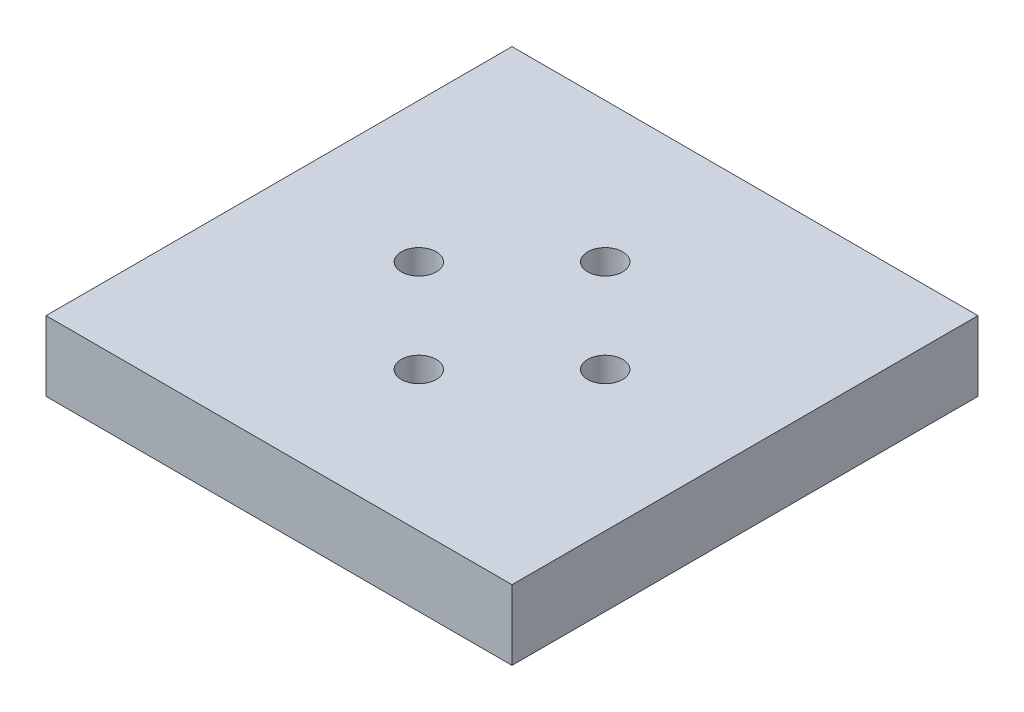
ISO-10303-21;
HEADER;
FILE_DESCRIPTION(('STEP AP214'),'2;1');
FILE_NAME('part.step','',(''),(''),'','','');
FILE_SCHEMA(('AUTOMOTIVE_DESIGN { 1 0 10303 214 1 1 1 1 }'));
ENDSEC;
DATA;
#1=APPLICATION_CONTEXT('core data for automotive mechanical design processes');
#2=APPLICATION_PROTOCOL_DEFINITION('international standard','automotive_design',2000,#1);
#3=PRODUCT_CONTEXT('',#1,'mechanical');
#4=PRODUCT('Part','Part','',(#3));
#5=PRODUCT_RELATED_PRODUCT_CATEGORY('part','',(#4));
#6=PRODUCT_DEFINITION_FORMATION('','',#4);
#7=PRODUCT_DEFINITION_CONTEXT('part definition',#1,'design');
#8=PRODUCT_DEFINITION('design','',#6,#7);
#9=PRODUCT_DEFINITION_SHAPE('','',#8);
#10=(LENGTH_UNIT() NAMED_UNIT(*) SI_UNIT(.MILLI.,.METRE.));
#11=(NAMED_UNIT(*) PLANE_ANGLE_UNIT() SI_UNIT($,.RADIAN.));
#12=(NAMED_UNIT(*) SI_UNIT($,.STERADIAN.) SOLID_ANGLE_UNIT());
#13=UNCERTAINTY_MEASURE_WITH_UNIT(LENGTH_MEASURE(1.E-05),#10,'distance_accuracy_value','');
#14=(GEOMETRIC_REPRESENTATION_CONTEXT(3) GLOBAL_UNCERTAINTY_ASSIGNED_CONTEXT((#13)) GLOBAL_UNIT_ASSIGNED_CONTEXT((#10,
#11,#12)) REPRESENTATION_CONTEXT('',''));
#15=CARTESIAN_POINT('',(0.,0.,0.));
#16=DIRECTION('',(0.,0.,1.));
#17=DIRECTION('',(1.,0.,0.));
#18=AXIS2_PLACEMENT_3D('',#15,#16,#17);
#19=CARTESIAN_POINT('',(0.,3.,0.));
#20=DIRECTION('',(0.,-1.,0.));
#21=DIRECTION('',(0.,0.,-1.));
#22=AXIS2_PLACEMENT_3D('',#19,#20,#21);
#23=PLANE('',#22);
#24=DIRECTION('',(0.,0.,-1.));
#25=VECTOR('',#24,1.);
#26=CARTESIAN_POINT('',(20.,3.,20.));
#27=LINE('',#26,#25);
#28=CARTESIAN_POINT('',(20.,3.,20.));
#29=VERTEX_POINT('',#28);
#30=CARTESIAN_POINT('',(20.,3.,-20.));
#31=VERTEX_POINT('',#30);
#32=EDGE_CURVE('E196',#29,#31,#27,.T.);
#33=ORIENTED_EDGE('',*,*,#32,.T.);
#34=DIRECTION('',(-1.,0.,0.));
#35=VECTOR('',#34,1.);
#36=CARTESIAN_POINT('',(-20.,3.,-20.));
#37=LINE('',#36,#35);
#38=CARTESIAN_POINT('',(-20.,3.,-20.));
#39=VERTEX_POINT('',#38);
#40=EDGE_CURVE('E203',#31,#39,#37,.T.);
#41=ORIENTED_EDGE('',*,*,#40,.T.);
#42=DIRECTION('',(0.,0.,1.));
#43=VECTOR('',#42,1.);
#44=CARTESIAN_POINT('',(-20.,3.,20.));
#45=LINE('',#44,#43);
#46=CARTESIAN_POINT('',(-20.,3.,20.));
#47=VERTEX_POINT('',#46);
#48=EDGE_CURVE('E206',#39,#47,#45,.T.);
#49=ORIENTED_EDGE('',*,*,#48,.T.);
#50=DIRECTION('',(1.,0.,0.));
#51=VECTOR('',#50,1.);
#52=CARTESIAN_POINT('',(-20.,3.,20.));
#53=LINE('',#52,#51);
#54=EDGE_CURVE('E209',#47,#29,#53,.T.);
#55=ORIENTED_EDGE('',*,*,#54,.T.);
#56=EDGE_LOOP('',(#33,#41,#49,#55));
#57=FACE_BOUND('',#56,.T.);
#58=CARTESIAN_POINT('',(0.,3.,-8.));
#59=DIRECTION('',(0.,1.,0.));
#60=DIRECTION('',(0.,0.,1.));
#61=AXIS2_PLACEMENT_3D('',#58,#59,#60);
#62=CIRCLE('',#61,1.5);
#63=CARTESIAN_POINT('',(0.,3.,-6.5));
#64=VERTEX_POINT('',#63);
#65=EDGE_CURVE('E192',#64,#64,#62,.T.);
#66=ORIENTED_EDGE('',*,*,#65,.F.);
#67=EDGE_LOOP('',(#66));
#68=FACE_BOUND('',#67,.T.);
#69=CARTESIAN_POINT('',(8.00000000000023,3.,-2.25904099284255E-13));
#70=DIRECTION('',(0.,1.,0.));
#71=DIRECTION('',(0.,0.,1.));
#72=AXIS2_PLACEMENT_3D('',#69,#70,#71);
#73=CIRCLE('',#72,1.50000000000018);
#74=CARTESIAN_POINT('',(8.00000000000023,3.,1.49999999999995));
#75=VERTEX_POINT('',#74);
#76=EDGE_CURVE('E184',#75,#75,#73,.T.);
#77=ORIENTED_EDGE('',*,*,#76,.F.);
#78=EDGE_LOOP('',(#77));
#79=FACE_BOUND('',#78,.T.);
#80=CARTESIAN_POINT('',(4.51808198568511E-13,3.,8.));
#81=DIRECTION('',(0.,1.,0.));
#82=DIRECTION('',(0.,0.,1.));
#83=AXIS2_PLACEMENT_3D('',#80,#81,#82);
#84=CIRCLE('',#83,1.50000000000049);
#85=CARTESIAN_POINT('',(4.51808198568511E-13,3.,9.50000000000048));
#86=VERTEX_POINT('',#85);
#87=EDGE_CURVE('E176',#86,#86,#84,.T.);
#88=ORIENTED_EDGE('',*,*,#87,.F.);
#89=EDGE_LOOP('',(#88));
#90=FACE_BOUND('',#89,.T.);
#91=CARTESIAN_POINT('',(-7.99999999999977,3.,2.26883816723573E-13));
#92=DIRECTION('',(0.,1.,0.));
#93=DIRECTION('',(0.,0.,1.));
#94=AXIS2_PLACEMENT_3D('',#91,#92,#93);
#95=CIRCLE('',#94,1.50000000000036);
#96=CARTESIAN_POINT('',(-7.99999999999977,3.,1.50000000000059));
#97=VERTEX_POINT('',#96);
#98=EDGE_CURVE('E168',#97,#97,#95,.T.);
#99=ORIENTED_EDGE('',*,*,#98,.F.);
#100=EDGE_LOOP('',(#99));
#101=FACE_BOUND('',#100,.T.);
#102=ADVANCED_FACE('F39',(#57,#68,#79,#90,#101),#23,.F.);
#103=CARTESIAN_POINT('',(0.,0.,0.));
#104=DIRECTION('',(0.,-1.,0.));
#105=DIRECTION('',(0.,0.,-1.));
#106=AXIS2_PLACEMENT_3D('',#103,#104,#105);
#107=PLANE('',#106);
#108=DIRECTION('',(-1.,0.,0.));
#109=VECTOR('',#108,1.);
#110=CARTESIAN_POINT('',(-16.,0.,16.));
#111=LINE('',#110,#109);
#112=CARTESIAN_POINT('',(16.,0.,16.));
#113=VERTEX_POINT('',#112);
#114=CARTESIAN_POINT('',(-16.,0.,16.));
#115=VERTEX_POINT('',#114);
#116=EDGE_CURVE('E55',#113,#115,#111,.T.);
#117=ORIENTED_EDGE('',*,*,#116,.T.);
#118=DIRECTION('',(0.,0.,-1.));
#119=VECTOR('',#118,1.);
#120=CARTESIAN_POINT('',(-16.,0.,16.));
#121=LINE('',#120,#119);
#122=CARTESIAN_POINT('',(-16.,0.,-16.));
#123=VERTEX_POINT('',#122);
#124=EDGE_CURVE('E59',#115,#123,#121,.T.);
#125=ORIENTED_EDGE('',*,*,#124,.T.);
#126=DIRECTION('',(1.,0.,0.));
#127=VECTOR('',#126,1.);
#128=CARTESIAN_POINT('',(-16.,0.,-16.));
#129=LINE('',#128,#127);
#130=CARTESIAN_POINT('',(16.,0.,-16.));
#131=VERTEX_POINT('',#130);
#132=EDGE_CURVE('E139',#123,#131,#129,.T.);
#133=ORIENTED_EDGE('',*,*,#132,.T.);
#134=DIRECTION('',(0.,0.,1.));
#135=VECTOR('',#134,1.);
#136=CARTESIAN_POINT('',(16.,0.,16.));
#137=LINE('',#136,#135);
#138=EDGE_CURVE('E114',#131,#113,#137,.T.);
#139=ORIENTED_EDGE('',*,*,#138,.T.);
#140=EDGE_LOOP('',(#117,#125,#133,#139));
#141=FACE_BOUND('',#140,.T.);
#142=CARTESIAN_POINT('',(4.51808198568511E-13,0.,8.));
#143=DIRECTION('',(0.,1.,0.));
#144=DIRECTION('',(0.,0.,1.));
#145=AXIS2_PLACEMENT_3D('',#142,#143,#144);
#146=CIRCLE('',#145,1.50000000000049);
#147=CARTESIAN_POINT('',(4.51808198568511E-13,0.,9.50000000000048));
#148=VERTEX_POINT('',#147);
#149=EDGE_CURVE('E172',#148,#148,#146,.T.);
#150=ORIENTED_EDGE('',*,*,#149,.T.);
#151=EDGE_LOOP('',(#150));
#152=FACE_BOUND('',#151,.T.);
#153=CARTESIAN_POINT('',(0.,0.,-8.));
#154=DIRECTION('',(0.,1.,0.));
#155=DIRECTION('',(0.,0.,1.));
#156=AXIS2_PLACEMENT_3D('',#153,#154,#155);
#157=CIRCLE('',#156,1.5);
#158=CARTESIAN_POINT('',(0.,0.,-6.5));
#159=VERTEX_POINT('',#158);
#160=EDGE_CURVE('E188',#159,#159,#157,.T.);
#161=ORIENTED_EDGE('',*,*,#160,.T.);
#162=EDGE_LOOP('',(#161));
#163=FACE_BOUND('',#162,.T.);
#164=CARTESIAN_POINT('',(8.00000000000023,0.,-2.25904099284255E-13));
#165=DIRECTION('',(0.,1.,0.));
#166=DIRECTION('',(0.,0.,1.));
#167=AXIS2_PLACEMENT_3D('',#164,#165,#166);
#168=CIRCLE('',#167,1.50000000000018);
#169=CARTESIAN_POINT('',(8.00000000000023,0.,1.49999999999995));
#170=VERTEX_POINT('',#169);
#171=EDGE_CURVE('E180',#170,#170,#168,.T.);
#172=ORIENTED_EDGE('',*,*,#171,.T.);
#173=EDGE_LOOP('',(#172));
#174=FACE_BOUND('',#173,.T.);
#175=CARTESIAN_POINT('',(-7.99999999999977,0.,2.26883816723573E-13));
#176=DIRECTION('',(0.,1.,0.));
#177=DIRECTION('',(0.,0.,1.));
#178=AXIS2_PLACEMENT_3D('',#175,#176,#177);
#179=CIRCLE('',#178,1.50000000000036);
#180=CARTESIAN_POINT('',(-7.99999999999977,0.,1.50000000000059));
#181=VERTEX_POINT('',#180);
#182=EDGE_CURVE('E167',#181,#181,#179,.T.);
#183=ORIENTED_EDGE('',*,*,#182,.T.);
#184=EDGE_LOOP('',(#183));
#185=FACE_BOUND('',#184,.T.);
#186=ADVANCED_FACE('F240',(#141,#152,#163,#174,#185),#107,.T.);
#187=CARTESIAN_POINT('',(20.,3.,20.));
#188=DIRECTION('',(-1.,0.,0.));
#189=DIRECTION('',(0.,0.,1.));
#190=AXIS2_PLACEMENT_3D('',#187,#188,#189);
#191=PLANE('',#190);
#192=DIRECTION('',(0.,-1.,0.));
#193=VECTOR('',#192,1.);
#194=CARTESIAN_POINT('',(20.,3.,20.));
#195=LINE('',#194,#193);
#196=CARTESIAN_POINT('',(20.,-3.,20.));
#197=VERTEX_POINT('',#196);
#198=EDGE_CURVE('E212',#29,#197,#195,.T.);
#199=ORIENTED_EDGE('',*,*,#198,.T.);
#200=DIRECTION('',(0.,0.,1.));
#201=VECTOR('',#200,1.);
#202=CARTESIAN_POINT('',(20.,-3.,20.));
#203=LINE('',#202,#201);
#204=CARTESIAN_POINT('',(20.,-3.,-20.));
#205=VERTEX_POINT('',#204);
#206=EDGE_CURVE('E159',#205,#197,#203,.T.);
#207=ORIENTED_EDGE('',*,*,#206,.F.);
#208=DIRECTION('',(0.,-1.,0.));
#209=VECTOR('',#208,1.);
#210=CARTESIAN_POINT('',(20.,3.,-20.));
#211=LINE('',#210,#209);
#212=EDGE_CURVE('E11',#31,#205,#211,.T.);
#213=ORIENTED_EDGE('',*,*,#212,.F.);
#214=ORIENTED_EDGE('',*,*,#32,.F.);
#215=EDGE_LOOP('',(#199,#207,#213,#214));
#216=FACE_BOUND('',#215,.T.);
#217=ADVANCED_FACE('F41',(#216),#191,.F.);
#218=CARTESIAN_POINT('',(-20.,3.,-20.));
#219=DIRECTION('',(0.,0.,1.));
#220=DIRECTION('',(1.,0.,0.));
#221=AXIS2_PLACEMENT_3D('',#218,#219,#220);
#222=PLANE('',#221);
#223=ORIENTED_EDGE('',*,*,#212,.T.);
#224=DIRECTION('',(1.,0.,0.));
#225=VECTOR('',#224,1.);
#226=CARTESIAN_POINT('',(-20.,-3.,-20.));
#227=LINE('',#226,#225);
#228=CARTESIAN_POINT('',(-20.,-3.,-20.));
#229=VERTEX_POINT('',#228);
#230=EDGE_CURVE('E155',#229,#205,#227,.T.);
#231=ORIENTED_EDGE('',*,*,#230,.F.);
#232=DIRECTION('',(0.,-1.,0.));
#233=VECTOR('',#232,1.);
#234=CARTESIAN_POINT('',(-20.,3.,-20.));
#235=LINE('',#234,#233);
#236=EDGE_CURVE('E48',#39,#229,#235,.T.);
#237=ORIENTED_EDGE('',*,*,#236,.F.);
#238=ORIENTED_EDGE('',*,*,#40,.F.);
#239=EDGE_LOOP('',(#223,#231,#237,#238));
#240=FACE_BOUND('',#239,.T.);
#241=ADVANCED_FACE('F226',(#240),#222,.F.);
#242=CARTESIAN_POINT('',(-20.,3.,20.));
#243=DIRECTION('',(1.,0.,0.));
#244=DIRECTION('',(0.,0.,-1.));
#245=AXIS2_PLACEMENT_3D('',#242,#243,#244);
#246=PLANE('',#245);
#247=ORIENTED_EDGE('',*,*,#236,.T.);
#248=DIRECTION('',(0.,0.,-1.));
#249=VECTOR('',#248,1.);
#250=CARTESIAN_POINT('',(-20.,-3.,20.));
#251=LINE('',#250,#249);
#252=CARTESIAN_POINT('',(-20.,-3.,20.));
#253=VERTEX_POINT('',#252);
#254=EDGE_CURVE('E120',#253,#229,#251,.T.);
#255=ORIENTED_EDGE('',*,*,#254,.F.);
#256=DIRECTION('',(0.,-1.,0.));
#257=VECTOR('',#256,1.);
#258=CARTESIAN_POINT('',(-20.,3.,20.));
#259=LINE('',#258,#257);
#260=EDGE_CURVE('E215',#47,#253,#259,.T.);
#261=ORIENTED_EDGE('',*,*,#260,.F.);
#262=ORIENTED_EDGE('',*,*,#48,.F.);
#263=EDGE_LOOP('',(#247,#255,#261,#262));
#264=FACE_BOUND('',#263,.T.);
#265=ADVANCED_FACE('F223',(#264),#246,.F.);
#266=CARTESIAN_POINT('',(-20.,3.,20.));
#267=DIRECTION('',(0.,0.,-1.));
#268=DIRECTION('',(-1.,0.,0.));
#269=AXIS2_PLACEMENT_3D('',#266,#267,#268);
#270=PLANE('',#269);
#271=ORIENTED_EDGE('',*,*,#260,.T.);
#272=DIRECTION('',(-1.,0.,0.));
#273=VECTOR('',#272,1.);
#274=CARTESIAN_POINT('',(-20.,-3.,20.));
#275=LINE('',#274,#273);
#276=EDGE_CURVE('E163',#197,#253,#275,.T.);
#277=ORIENTED_EDGE('',*,*,#276,.F.);
#278=ORIENTED_EDGE('',*,*,#198,.F.);
#279=ORIENTED_EDGE('',*,*,#54,.F.);
#280=EDGE_LOOP('',(#271,#277,#278,#279));
#281=FACE_BOUND('',#280,.T.);
#282=ADVANCED_FACE('F233',(#281),#270,.F.);
#283=CARTESIAN_POINT('',(0.,3.,-8.));
#284=DIRECTION('',(0.,-1.,0.));
#285=DIRECTION('',(0.,0.,-1.));
#286=AXIS2_PLACEMENT_3D('',#283,#284,#285);
#287=CYLINDRICAL_SURFACE('',#286,1.5);
#288=ORIENTED_EDGE('',*,*,#65,.T.);
#289=EDGE_LOOP('',(#288));
#290=FACE_BOUND('',#289,.T.);
#291=ORIENTED_EDGE('',*,*,#160,.F.);
#292=EDGE_LOOP('',(#291));
#293=FACE_BOUND('',#292,.T.);
#294=ADVANCED_FACE('F251',(#290,#293),#287,.F.);
#295=CARTESIAN_POINT('',(8.00000000000023,3.,-2.25904099284255E-13));
#296=DIRECTION('',(0.,-1.,0.));
#297=DIRECTION('',(0.,0.,-1.));
#298=AXIS2_PLACEMENT_3D('',#295,#296,#297);
#299=CYLINDRICAL_SURFACE('',#298,1.50000000000018);
#300=ORIENTED_EDGE('',*,*,#76,.T.);
#301=EDGE_LOOP('',(#300));
#302=FACE_BOUND('',#301,.T.);
#303=ORIENTED_EDGE('',*,*,#171,.F.);
#304=EDGE_LOOP('',(#303));
#305=FACE_BOUND('',#304,.T.);
#306=ADVANCED_FACE('F272',(#302,#305),#299,.F.);
#307=CARTESIAN_POINT('',(4.51808198568511E-13,3.,8.));
#308=DIRECTION('',(0.,-1.,0.));
#309=DIRECTION('',(0.,0.,-1.));
#310=AXIS2_PLACEMENT_3D('',#307,#308,#309);
#311=CYLINDRICAL_SURFACE('',#310,1.50000000000049);
#312=ORIENTED_EDGE('',*,*,#87,.T.);
#313=EDGE_LOOP('',(#312));
#314=FACE_BOUND('',#313,.T.);
#315=ORIENTED_EDGE('',*,*,#149,.F.);
#316=EDGE_LOOP('',(#315));
#317=FACE_BOUND('',#316,.T.);
#318=ADVANCED_FACE('F279',(#314,#317),#311,.F.);
#319=CARTESIAN_POINT('',(-7.99999999999977,3.,2.26883816723573E-13));
#320=DIRECTION('',(0.,-1.,0.));
#321=DIRECTION('',(0.,0.,-1.));
#322=AXIS2_PLACEMENT_3D('',#319,#320,#321);
#323=CYLINDRICAL_SURFACE('',#322,1.50000000000036);
#324=ORIENTED_EDGE('',*,*,#98,.T.);
#325=EDGE_LOOP('',(#324));
#326=FACE_BOUND('',#325,.T.);
#327=ORIENTED_EDGE('',*,*,#182,.F.);
#328=EDGE_LOOP('',(#327));
#329=FACE_BOUND('',#328,.T.);
#330=ADVANCED_FACE('F286',(#326,#329),#323,.F.);
#331=CARTESIAN_POINT('',(0.,-3.,0.));
#332=DIRECTION('',(0.,-1.,0.));
#333=DIRECTION('',(0.,0.,-1.));
#334=AXIS2_PLACEMENT_3D('',#331,#332,#333);
#335=PLANE('',#334);
#336=ORIENTED_EDGE('',*,*,#254,.T.);
#337=ORIENTED_EDGE('',*,*,#230,.T.);
#338=ORIENTED_EDGE('',*,*,#206,.T.);
#339=ORIENTED_EDGE('',*,*,#276,.T.);
#340=EDGE_LOOP('',(#336,#337,#338,#339));
#341=FACE_BOUND('',#340,.T.);
#342=DIRECTION('',(0.,0.,-1.));
#343=VECTOR('',#342,1.);
#344=CARTESIAN_POINT('',(-16.,-3.,16.));
#345=LINE('',#344,#343);
#346=CARTESIAN_POINT('',(-16.,-3.,16.));
#347=VERTEX_POINT('',#346);
#348=CARTESIAN_POINT('',(-16.,-3.,-16.));
#349=VERTEX_POINT('',#348);
#350=EDGE_CURVE('E113',#347,#349,#345,.T.);
#351=ORIENTED_EDGE('',*,*,#350,.F.);
#352=DIRECTION('',(-1.,0.,0.));
#353=VECTOR('',#352,1.);
#354=CARTESIAN_POINT('',(-16.,-3.,16.));
#355=LINE('',#354,#353);
#356=CARTESIAN_POINT('',(16.,-3.,16.));
#357=VERTEX_POINT('',#356);
#358=EDGE_CURVE('E103',#357,#347,#355,.T.);
#359=ORIENTED_EDGE('',*,*,#358,.F.);
#360=DIRECTION('',(0.,0.,1.));
#361=VECTOR('',#360,1.);
#362=CARTESIAN_POINT('',(16.,-3.,16.));
#363=LINE('',#362,#361);
#364=CARTESIAN_POINT('',(16.,-3.,-16.));
#365=VERTEX_POINT('',#364);
#366=EDGE_CURVE('E130',#365,#357,#363,.T.);
#367=ORIENTED_EDGE('',*,*,#366,.F.);
#368=DIRECTION('',(1.,0.,0.));
#369=VECTOR('',#368,1.);
#370=CARTESIAN_POINT('',(-16.,-3.,-16.));
#371=LINE('',#370,#369);
#372=EDGE_CURVE('E126',#349,#365,#371,.T.);
#373=ORIENTED_EDGE('',*,*,#372,.F.);
#374=EDGE_LOOP('',(#351,#359,#367,#373));
#375=FACE_BOUND('',#374,.T.);
#376=ADVANCED_FACE('F124',(#341,#375),#335,.T.);
#377=CARTESIAN_POINT('',(-16.,-3.,16.));
#378=DIRECTION('',(0.,0.,-1.));
#379=DIRECTION('',(-1.,0.,0.));
#380=AXIS2_PLACEMENT_3D('',#377,#378,#379);
#381=PLANE('',#380);
#382=ORIENTED_EDGE('',*,*,#116,.F.);
#383=DIRECTION('',(0.,1.,0.));
#384=VECTOR('',#383,1.);
#385=CARTESIAN_POINT('',(16.,-3.,16.));
#386=LINE('',#385,#384);
#387=EDGE_CURVE('E108',#357,#113,#386,.T.);
#388=ORIENTED_EDGE('',*,*,#387,.F.);
#389=ORIENTED_EDGE('',*,*,#358,.T.);
#390=DIRECTION('',(0.,1.,0.));
#391=VECTOR('',#390,1.);
#392=CARTESIAN_POINT('',(-16.,-3.,16.));
#393=LINE('',#392,#391);
#394=EDGE_CURVE('E106',#347,#115,#393,.T.);
#395=ORIENTED_EDGE('',*,*,#394,.T.);
#396=EDGE_LOOP('',(#382,#388,#389,#395));
#397=FACE_BOUND('',#396,.T.);
#398=ADVANCED_FACE('F105',(#397),#381,.T.);
#399=CARTESIAN_POINT('',(-16.,-3.,16.));
#400=DIRECTION('',(1.,0.,0.));
#401=DIRECTION('',(0.,0.,-1.));
#402=AXIS2_PLACEMENT_3D('',#399,#400,#401);
#403=PLANE('',#402);
#404=ORIENTED_EDGE('',*,*,#124,.F.);
#405=ORIENTED_EDGE('',*,*,#394,.F.);
#406=ORIENTED_EDGE('',*,*,#350,.T.);
#407=DIRECTION('',(0.,1.,0.));
#408=VECTOR('',#407,1.);
#409=CARTESIAN_POINT('',(-16.,-3.,-16.));
#410=LINE('',#409,#408);
#411=EDGE_CURVE('E121',#349,#123,#410,.T.);
#412=ORIENTED_EDGE('',*,*,#411,.T.);
#413=EDGE_LOOP('',(#404,#405,#406,#412));
#414=FACE_BOUND('',#413,.T.);
#415=ADVANCED_FACE('F117',(#414),#403,.T.);
#416=CARTESIAN_POINT('',(-16.,-3.,-16.));
#417=DIRECTION('',(0.,0.,1.));
#418=DIRECTION('',(1.,0.,0.));
#419=AXIS2_PLACEMENT_3D('',#416,#417,#418);
#420=PLANE('',#419);
#421=ORIENTED_EDGE('',*,*,#132,.F.);
#422=ORIENTED_EDGE('',*,*,#411,.F.);
#423=ORIENTED_EDGE('',*,*,#372,.T.);
#424=DIRECTION('',(0.,1.,0.));
#425=VECTOR('',#424,1.);
#426=CARTESIAN_POINT('',(16.,-3.,-16.));
#427=LINE('',#426,#425);
#428=EDGE_CURVE('E146',#365,#131,#427,.T.);
#429=ORIENTED_EDGE('',*,*,#428,.T.);
#430=EDGE_LOOP('',(#421,#422,#423,#429));
#431=FACE_BOUND('',#430,.T.);
#432=ADVANCED_FACE('F313',(#431),#420,.T.);
#433=CARTESIAN_POINT('',(16.,-3.,16.));
#434=DIRECTION('',(-1.,0.,0.));
#435=DIRECTION('',(0.,0.,1.));
#436=AXIS2_PLACEMENT_3D('',#433,#434,#435);
#437=PLANE('',#436);
#438=ORIENTED_EDGE('',*,*,#138,.F.);
#439=ORIENTED_EDGE('',*,*,#428,.F.);
#440=ORIENTED_EDGE('',*,*,#366,.T.);
#441=ORIENTED_EDGE('',*,*,#387,.T.);
#442=EDGE_LOOP('',(#438,#439,#440,#441));
#443=FACE_BOUND('',#442,.T.);
#444=ADVANCED_FACE('F320',(#443),#437,.T.);
#445=CLOSED_SHELL('',(#102,#186,#217,#241,#265,#282,#294,#306,#318,#330,#376,#398,#415,#432,#444));
#446=MANIFOLD_SOLID_BREP('B2',#445);
#447=ADVANCED_BREP_SHAPE_REPRESENTATION('',(#18,#446),#14);
#448=SHAPE_DEFINITION_REPRESENTATION(#9,#447);
ENDSEC;
END-ISO-10303-21;
